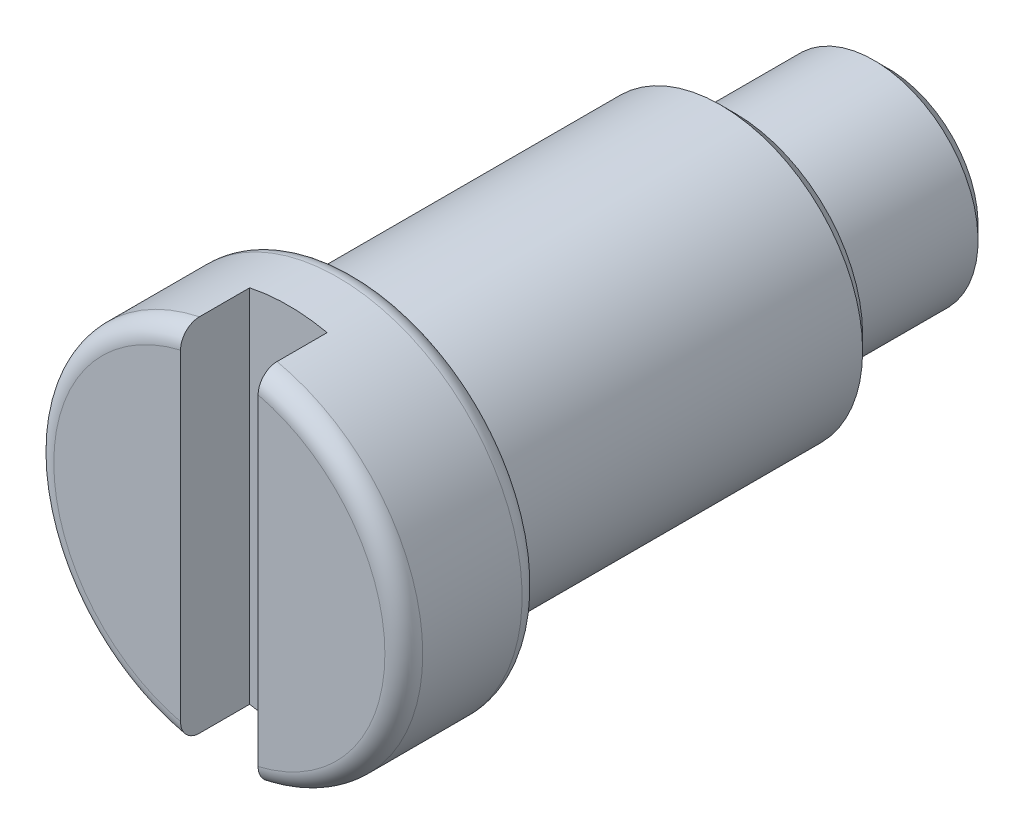
ISO-10303-21;
HEADER;
FILE_DESCRIPTION(('STEP AP214'),'2;1');
FILE_NAME('part.step','',(''),(''),'','','');
FILE_SCHEMA(('AUTOMOTIVE_DESIGN { 1 0 10303 214 1 1 1 1 }'));
ENDSEC;
DATA;
#1=APPLICATION_CONTEXT('core data for automotive mechanical design processes');
#2=APPLICATION_PROTOCOL_DEFINITION('international standard','automotive_design',2000,#1);
#3=PRODUCT_CONTEXT('',#1,'mechanical');
#4=PRODUCT('Part','Part','',(#3));
#5=PRODUCT_RELATED_PRODUCT_CATEGORY('part','',(#4));
#6=PRODUCT_DEFINITION_FORMATION('','',#4);
#7=PRODUCT_DEFINITION_CONTEXT('part definition',#1,'design');
#8=PRODUCT_DEFINITION('design','',#6,#7);
#9=PRODUCT_DEFINITION_SHAPE('','',#8);
#10=(LENGTH_UNIT() NAMED_UNIT(*) SI_UNIT(.MILLI.,.METRE.));
#11=(NAMED_UNIT(*) PLANE_ANGLE_UNIT() SI_UNIT($,.RADIAN.));
#12=(NAMED_UNIT(*) SI_UNIT($,.STERADIAN.) SOLID_ANGLE_UNIT());
#13=UNCERTAINTY_MEASURE_WITH_UNIT(LENGTH_MEASURE(1.E-05),#10,'distance_accuracy_value','');
#14=(GEOMETRIC_REPRESENTATION_CONTEXT(3) GLOBAL_UNCERTAINTY_ASSIGNED_CONTEXT((#13)) GLOBAL_UNIT_ASSIGNED_CONTEXT((#10,
#11,#12)) REPRESENTATION_CONTEXT('',''));
#15=CARTESIAN_POINT('',(0.,0.,0.));
#16=DIRECTION('',(0.,0.,1.));
#17=DIRECTION('',(1.,0.,0.));
#18=AXIS2_PLACEMENT_3D('',#15,#16,#17);
#19=CARTESIAN_POINT('',(-0.41,-8.96687794051,-0.73));
#20=DIRECTION('',(0.,0.,1.));
#21=DIRECTION('',(1.,0.,0.));
#22=AXIS2_PLACEMENT_3D('',#19,#20,#21);
#23=PLANE('',#22);
#24=CARTESIAN_POINT('',(0.,0.,-0.73));
#25=DIRECTION('',(0.,0.,-1.));
#26=DIRECTION('',(-1.,0.,0.));
#27=AXIS2_PLACEMENT_3D('',#24,#25,#26);
#28=CIRCLE('',#27,1.95);
#29=CARTESIAN_POINT('',(0.41,1.9064102391754,-0.73));
#30=VERTEX_POINT('',#29);
#31=CARTESIAN_POINT('',(-0.41,1.9064102391669,-0.73));
#32=VERTEX_POINT('',#31);
#33=EDGE_CURVE('E80',#30,#32,#28,.F.);
#34=ORIENTED_EDGE('',*,*,#33,.T.);
#35=DIRECTION('',(0.,1.,0.));
#36=VECTOR('',#35,1.);
#37=CARTESIAN_POINT('',(-0.41,-8.96687794051,-0.73));
#38=LINE('',#37,#36);
#39=CARTESIAN_POINT('',(-0.41,-1.9064102391669,-0.73));
#40=VERTEX_POINT('',#39);
#41=EDGE_CURVE('E82',#40,#32,#38,.T.);
#42=ORIENTED_EDGE('',*,*,#41,.F.);
#43=CARTESIAN_POINT('',(0.,0.,-0.73));
#44=DIRECTION('',(0.,0.,-1.));
#45=DIRECTION('',(-1.,0.,0.));
#46=AXIS2_PLACEMENT_3D('',#43,#44,#45);
#47=CIRCLE('',#46,1.95);
#48=CARTESIAN_POINT('',(0.41,-1.9064102391669,-0.73));
#49=VERTEX_POINT('',#48);
#50=EDGE_CURVE('E20',#40,#49,#47,.F.);
#51=ORIENTED_EDGE('',*,*,#50,.T.);
#52=DIRECTION('',(0.,1.,0.));
#53=VECTOR('',#52,1.);
#54=CARTESIAN_POINT('',(0.41,-8.96687794051,-0.73));
#55=LINE('',#54,#53);
#56=EDGE_CURVE('E89',#30,#49,#55,.F.);
#57=ORIENTED_EDGE('',*,*,#56,.F.);
#58=EDGE_LOOP('',(#34,#42,#51,#57));
#59=FACE_BOUND('',#58,.T.);
#60=ADVANCED_FACE('F17',(#59),#23,.T.);
#61=CARTESIAN_POINT('',(0.41,-8.96687794051,-0.73));
#62=DIRECTION('',(-1.,0.,0.));
#63=DIRECTION('',(0.,0.,1.));
#64=AXIS2_PLACEMENT_3D('',#61,#62,#63);
#65=PLANE('',#64);
#66=DIRECTION('',(0.,0.,1.));
#67=VECTOR('',#66,1.);
#68=CARTESIAN_POINT('',(0.41,1.906410239184,-0.73));
#69=LINE('',#68,#67);
#70=CARTESIAN_POINT('',(0.41,1.9064102391754,-0.199999999997));
#71=VERTEX_POINT('',#70);
#72=EDGE_CURVE('E91',#71,#30,#69,.F.);
#73=ORIENTED_EDGE('',*,*,#72,.T.);
#74=ORIENTED_EDGE('',*,*,#56,.T.);
#75=DIRECTION('',(0.,0.,1.));
#76=VECTOR('',#75,1.);
#77=CARTESIAN_POINT('',(0.41,-1.906410239167,-0.73));
#78=LINE('',#77,#76);
#79=CARTESIAN_POINT('',(0.409999999999999,-1.9064102391669,-0.1999999999982));
#80=VERTEX_POINT('',#79);
#81=EDGE_CURVE('E76',#49,#80,#78,.T.);
#82=ORIENTED_EDGE('',*,*,#81,.T.);
#83=CARTESIAN_POINT('',(0.409999999999999,-1.9064102391668,-0.1999999999994));
#84=CARTESIAN_POINT('',(0.410000000000001,-1.90642073201662,-0.188935909425886));
#85=CARTESIAN_POINT('',(0.41,-1.90547181301739,-0.17787601446626));
#86=CARTESIAN_POINT('',(0.409999999999999,-1.90173416208713,-0.156086634893258));
#87=CARTESIAN_POINT('',(0.409999999999998,-1.89894796519605,-0.14535671630541));
#88=CARTESIAN_POINT('',(0.409999999999998,-1.89161334067293,-0.12451421506964));
#89=CARTESIAN_POINT('',(0.409999999999999,-1.88706441660261,-0.11440180726134));
#90=CARTESIAN_POINT('',(0.41,-1.87634918228616,-0.095075278442462));
#91=CARTESIAN_POINT('',(0.409999999999999,-1.87018289207332,-0.0858611463074552));
#92=CARTESIAN_POINT('',(0.409999999999999,-1.85635504906559,-0.0684963080743695));
#93=CARTESIAN_POINT('',(0.41,-1.84868044255964,-0.0603560043149509));
#94=CARTESIAN_POINT('',(0.409999999999999,-1.83209823806731,-0.0454459635773487));
#95=CARTESIAN_POINT('',(0.409999999999998,-1.82319043083293,-0.0386764596758893));
#96=CARTESIAN_POINT('',(0.409999999999998,-1.80419297936883,-0.0265439694319283));
#97=CARTESIAN_POINT('',(0.409999999999999,-1.79408202654268,-0.0212143879963644));
#98=CARTESIAN_POINT('',(0.41,-1.77312406597645,-0.012284540769646));
#99=CARTESIAN_POINT('',(0.409999999999999,-1.76227719565737,-0.00868395312492724));
#100=CARTESIAN_POINT('',(0.409999999999999,-1.74304683526872,-0.00399599964380329));
#101=CARTESIAN_POINT('',(0.409999999999999,-1.73476082665802,-0.00249765790653519));
#102=CARTESIAN_POINT('',(0.41,-1.71808183905436,-0.000499679376716791));
#103=CARTESIAN_POINT('',(0.410000000000001,-1.70968903928075,1.45300888987605E-06));
#104=CARTESIAN_POINT('',(0.410000000000001,-1.70129362545099,0.));
#105=B_SPLINE_CURVE_WITH_KNOTS('',3,(#83,#84,#85,#86,#87,#88,#89,#90,#91,#92,#93,#94,#95,#96,
#97,#98,#99,#100,#101,#102,#103,#104),.UNSPECIFIED.,.F.,.F.,(4,2,2,2,2,2,2,2,2,2,4),(0.,
0.0331453845891454,0.0662451312529841,0.0993542066082952,0.132462871881988,0.165871807589145,
0.199286419047546,0.233420144854118,0.267547514175047,0.292751405910464,0.317917468817511),.UNSPECIFIED.);
#106=CARTESIAN_POINT('',(0.41,-1.701293625451,0.));
#107=VERTEX_POINT('',#106);
#108=EDGE_CURVE('E99',#80,#107,#105,.T.);
#109=ORIENTED_EDGE('',*,*,#108,.T.);
#110=DIRECTION('',(0.,1.,0.));
#111=VECTOR('',#110,1.);
#112=CARTESIAN_POINT('',(0.41,0.,0.));
#113=LINE('',#112,#111);
#114=CARTESIAN_POINT('',(0.41,1.701293625451,0.));
#115=VERTEX_POINT('',#114);
#116=EDGE_CURVE('E119',#107,#115,#113,.T.);
#117=ORIENTED_EDGE('',*,*,#116,.T.);
#118=CARTESIAN_POINT('',(0.409999999999999,1.701293625451,0.));
#119=CARTESIAN_POINT('',(0.410000000002229,1.71306590904861,8.78214871465354E-06));
#120=CARTESIAN_POINT('',(0.410000000001304,1.7248381977497,-0.000981901612816971));
#121=CARTESIAN_POINT('',(0.409999999998695,1.74805561338932,-0.00490756838201299));
#122=CARTESIAN_POINT('',(0.409999999997009,1.75950069623836,-0.00784281213418027));
#123=CARTESIAN_POINT('',(0.409999999998427,1.78174299074401,-0.0156063587050561));
#124=CARTESIAN_POINT('',(0.410000000001535,1.79253962254991,-0.0204363275759226));
#125=CARTESIAN_POINT('',(0.409999999998465,1.81314685306385,-0.0318657093925813));
#126=CARTESIAN_POINT('',(0.409999999992293,1.82295790720166,-0.0384642998495639));
#127=CARTESIAN_POINT('',(0.409999999993566,1.84115406576136,-0.0531454088814542));
#128=CARTESIAN_POINT('',(0.410000000000806,1.84955854059986,-0.0612039028652662));
#129=CARTESIAN_POINT('',(0.409999999999194,1.86485290917502,-0.0786481254288913));
#130=CARTESIAN_POINT('',(0.409999999990345,1.87174315662201,-0.0880335432073086));
#131=CARTESIAN_POINT('',(0.409999999989569,1.88363996534004,-0.107622254778722));
#132=CARTESIAN_POINT('',(0.409999999997243,1.88868763260167,-0.117800622631082));
#133=CARTESIAN_POINT('',(0.410000000002754,1.89695967352409,-0.138868589182004));
#134=CARTESIAN_POINT('',(0.410000000000601,1.90018573741462,-0.149757518062343));
#135=CARTESIAN_POINT('',(0.40999999999965,1.90376613264431,-0.167279422370648));
#136=CARTESIAN_POINT('',(0.409999999999825,1.90475718075972,-0.173788735975535));
#137=CARTESIAN_POINT('',(0.410000000000174,1.90607898727918,-0.186864323551235));
#138=CARTESIAN_POINT('',(0.410000000000346,1.90641071913279,-0.193430499149179));
#139=CARTESIAN_POINT('',(0.409999999999992,1.9064102391668,-0.199999999998196));
#140=B_SPLINE_CURVE_WITH_KNOTS('',3,(#118,#119,#120,#121,#122,#123,#124,#125,#126,#127,#128,
#129,#130,#131,#132,#133,#134,#135,#136,#137,#138,#139),.UNSPECIFIED.,.F.,.F.,(4,2,2,2,2,2,2,2,
2,2,4),(0.,0.0352756157378741,0.0705559625126531,0.105867401464157,0.141162447410486,
0.175922174914147,0.210673774197639,0.244594325750203,0.278483351153767,0.298206112665351,
0.317899732747287),.UNSPECIFIED.);
#141=EDGE_CURVE('E98',#115,#71,#140,.T.);
#142=ORIENTED_EDGE('',*,*,#141,.T.);
#143=EDGE_LOOP('',(#73,#74,#82,#109,#117,#142));
#144=FACE_BOUND('',#143,.T.);
#145=ADVANCED_FACE('F354',(#144),#65,.T.);
#146=CARTESIAN_POINT('',(-0.41,-8.96687794051,0.));
#147=DIRECTION('',(1.,0.,0.));
#148=DIRECTION('',(0.,0.,-1.));
#149=AXIS2_PLACEMENT_3D('',#146,#147,#148);
#150=PLANE('',#149);
#151=DIRECTION('',(0.,1.,0.));
#152=VECTOR('',#151,1.);
#153=CARTESIAN_POINT('',(-0.41,0.,0.));
#154=LINE('',#153,#152);
#155=CARTESIAN_POINT('',(-0.41,1.701293625451,0.));
#156=VERTEX_POINT('',#155);
#157=CARTESIAN_POINT('',(-0.41,-1.701293625451,0.));
#158=VERTEX_POINT('',#157);
#159=EDGE_CURVE('E117',#156,#158,#154,.F.);
#160=ORIENTED_EDGE('',*,*,#159,.T.);
#161=CARTESIAN_POINT('',(-0.41,-1.701293625451,0.));
#162=CARTESIAN_POINT('',(-0.41000000000223,-1.71306590904861,8.78214871464386E-06));
#163=CARTESIAN_POINT('',(-0.410000000001305,-1.7248381977497,-0.000981901612817001));
#164=CARTESIAN_POINT('',(-0.409999999998695,-1.74805561338932,-0.00490756838201304));
#165=CARTESIAN_POINT('',(-0.409999999997009,-1.75950069623836,-0.00784281213418028));
#166=CARTESIAN_POINT('',(-0.409999999998427,-1.78174299074401,-0.015606358705056));
#167=CARTESIAN_POINT('',(-0.410000000001535,-1.79253962254991,-0.0204363275759224));
#168=CARTESIAN_POINT('',(-0.409999999998466,-1.81314685306385,-0.0318657093925812));
#169=CARTESIAN_POINT('',(-0.409999999992294,-1.82295790720166,-0.038464299849564));
#170=CARTESIAN_POINT('',(-0.409999999993567,-1.84115406576136,-0.0531454088814543));
#171=CARTESIAN_POINT('',(-0.410000000000806,-1.84955854059986,-0.0612039028652663));
#172=CARTESIAN_POINT('',(-0.409999999999194,-1.86485290917502,-0.0786481254288913));
#173=CARTESIAN_POINT('',(-0.409999999990345,-1.87174315662201,-0.0880335432073086));
#174=CARTESIAN_POINT('',(-0.40999999998957,-1.88363996534004,-0.107622254778722));
#175=CARTESIAN_POINT('',(-0.409999999997244,-1.88868763260167,-0.117800622631081));
#176=CARTESIAN_POINT('',(-0.410000000002754,-1.89695967352409,-0.138868589182003));
#177=CARTESIAN_POINT('',(-0.410000000000599,-1.90018573741462,-0.149757518062343));
#178=CARTESIAN_POINT('',(-0.409999999999648,-1.90376613264437,-0.167279422370942));
#179=CARTESIAN_POINT('',(-0.409999999999825,-1.90475718075981,-0.173788735976129));
#180=CARTESIAN_POINT('',(-0.410000000000175,-1.90607898727927,-0.186864323552431));
#181=CARTESIAN_POINT('',(-0.410000000000348,-1.90641071913285,-0.193430499150679));
#182=CARTESIAN_POINT('',(-0.409999999999993,-1.9064102391668,-0.199999999999996));
#183=B_SPLINE_CURVE_WITH_KNOTS('',3,(#161,#162,#163,#164,#165,#166,#167,#168,#169,#170,#171,
#172,#173,#174,#175,#176,#177,#178,#179,#180,#181,#182),.UNSPECIFIED.,.F.,.F.,(4,2,2,2,2,2,2,2,
2,2,4),(0.,0.0352756157378745,0.0705559625126533,0.105867401464157,0.141162447410486,
0.175922174914147,0.210673774197639,0.244594325750202,0.278483351153768,0.29820611266625,
0.317899732749085),.UNSPECIFIED.);
#184=CARTESIAN_POINT('',(-0.41,-1.9064102391669,-0.2));
#185=VERTEX_POINT('',#184);
#186=EDGE_CURVE('E35',#158,#185,#183,.T.);
#187=ORIENTED_EDGE('',*,*,#186,.T.);
#188=DIRECTION('',(0.,0.,-1.));
#189=VECTOR('',#188,1.);
#190=CARTESIAN_POINT('',(-0.41,-1.906410239167,0.));
#191=LINE('',#190,#189);
#192=EDGE_CURVE('E73',#185,#40,#191,.T.);
#193=ORIENTED_EDGE('',*,*,#192,.T.);
#194=ORIENTED_EDGE('',*,*,#41,.T.);
#195=DIRECTION('',(0.,0.,-1.));
#196=VECTOR('',#195,1.);
#197=CARTESIAN_POINT('',(-0.41,1.906410239167,0.));
#198=LINE('',#197,#196);
#199=CARTESIAN_POINT('',(-0.41,1.9064102391669,-0.2));
#200=VERTEX_POINT('',#199);
#201=EDGE_CURVE('E86',#32,#200,#198,.F.);
#202=ORIENTED_EDGE('',*,*,#201,.T.);
#203=CARTESIAN_POINT('',(-0.41,1.9064102391668,-0.2));
#204=CARTESIAN_POINT('',(-0.41,1.90642073201665,-0.188935909426487));
#205=CARTESIAN_POINT('',(-0.41,1.90547181301746,-0.177876014466859));
#206=CARTESIAN_POINT('',(-0.41,1.90173416208727,-0.156086634893848));
#207=CARTESIAN_POINT('',(-0.41,1.89894796519622,-0.145356716305992));
#208=CARTESIAN_POINT('',(-0.41,1.89161334067317,-0.124514215070201));
#209=CARTESIAN_POINT('',(-0.41,1.88706441660288,-0.114401807261888));
#210=CARTESIAN_POINT('',(-0.41,1.87634918228649,-0.0950752784429788));
#211=CARTESIAN_POINT('',(-0.409999999999999,1.87018289207367,-0.085861146307954));
#212=CARTESIAN_POINT('',(-0.41,1.856355049066,-0.0684963080748281));
#213=CARTESIAN_POINT('',(-0.41,1.84868044256008,-0.0603560043153873));
#214=CARTESIAN_POINT('',(-0.41,1.83209823806779,-0.045445963577737));
#215=CARTESIAN_POINT('',(-0.41,1.82319043083343,-0.0386764596762518));
#216=CARTESIAN_POINT('',(-0.409999999999999,1.80419297936938,-0.0265439694322356));
#217=CARTESIAN_POINT('',(-0.41,1.79408202654325,-0.0212143879966421));
#218=CARTESIAN_POINT('',(-0.41,1.77312406597704,-0.012284540769862));
#219=CARTESIAN_POINT('',(-0.41,1.76227719565798,-0.00868395312511121));
#220=CARTESIAN_POINT('',(-0.41,1.74304683526924,-0.00399599964390427));
#221=CARTESIAN_POINT('',(-0.41,1.73476082665844,-0.00249765790659835));
#222=CARTESIAN_POINT('',(-0.41,1.71808183905457,-0.000499679376729377));
#223=CARTESIAN_POINT('',(-0.41,1.70968903928086,1.45300889005112E-06));
#224=CARTESIAN_POINT('',(-0.410000000000001,1.70129362545099,0.));
#225=B_SPLINE_CURVE_WITH_KNOTS('',3,(#203,#204,#205,#206,#207,#208,#209,#210,#211,#212,#213,
#214,#215,#216,#217,#218,#219,#220,#221,#222,#223,#224),.UNSPECIFIED.,.F.,.F.,(4,2,2,2,2,2,2,2,
2,2,4),(0.,0.0331453845891425,0.0662451312529782,0.0993542066082864,0.132462871881977,
0.165871807589129,0.199286419047523,0.233420144854088,0.26754751417501,0.292751405910745,
0.31791746881811),.UNSPECIFIED.);
#226=EDGE_CURVE('E120',#200,#156,#225,.T.);
#227=ORIENTED_EDGE('',*,*,#226,.T.);
#228=EDGE_LOOP('',(#160,#187,#193,#194,#202,#227));
#229=FACE_BOUND('',#228,.T.);
#230=ADVANCED_FACE('F88',(#229),#150,.T.);
#231=CARTESIAN_POINT('',(0.,0.,-7.07));
#232=DIRECTION('',(0.,0.,-1.));
#233=DIRECTION('',(-1.,0.,0.));
#234=AXIS2_PLACEMENT_3D('',#231,#232,#233);
#235=PLANE('',#234);
#236=CARTESIAN_POINT('',(0.,0.,-7.06999999994196));
#237=DIRECTION('',(0.,0.,1.));
#238=DIRECTION('',(0.,-1.,0.));
#239=AXIS2_PLACEMENT_3D('',#236,#237,#238);
#240=CIRCLE('',#239,0.950000000045748);
#241=CARTESIAN_POINT('',(0.,-0.950000000045747,-7.06999999994196));
#242=VERTEX_POINT('',#241);
#243=EDGE_CURVE('E113',#242,#242,#240,.T.);
#244=ORIENTED_EDGE('',*,*,#243,.F.);
#245=EDGE_LOOP('',(#244));
#246=FACE_BOUND('',#245,.T.);
#247=ADVANCED_FACE('F176',(#246),#235,.T.);
#248=CARTESIAN_POINT('',(0.,0.,0.));
#249=DIRECTION('',(0.,0.,-1.));
#250=DIRECTION('',(-1.,0.,0.));
#251=AXIS2_PLACEMENT_3D('',#248,#249,#250);
#252=PLANE('',#251);
#253=ORIENTED_EDGE('',*,*,#116,.F.);
#254=CARTESIAN_POINT('',(0.,0.,0.));
#255=DIRECTION('',(0.,0.,-1.));
#256=DIRECTION('',(0.234285714285706,0.972167785971967,0.));
#257=AXIS2_PLACEMENT_3D('',#254,#255,#256);
#258=CIRCLE('',#257,1.75000000000006);
#259=EDGE_CURVE('E116',#115,#107,#258,.T.);
#260=ORIENTED_EDGE('',*,*,#259,.F.);
#261=EDGE_LOOP('',(#253,#260));
#262=FACE_BOUND('',#261,.T.);
#263=ADVANCED_FACE('F173',(#262),#252,.F.);
#264=CARTESIAN_POINT('',(0.,0.,0.));
#265=DIRECTION('',(0.,0.,-1.));
#266=DIRECTION('',(-1.,0.,0.));
#267=AXIS2_PLACEMENT_3D('',#264,#265,#266);
#268=PLANE('',#267);
#269=CARTESIAN_POINT('',(0.,0.,0.));
#270=DIRECTION('',(0.,0.,-1.));
#271=DIRECTION('',(-0.234285714285706,-0.972167785971967,0.));
#272=AXIS2_PLACEMENT_3D('',#269,#270,#271);
#273=CIRCLE('',#272,1.75000000000006);
#274=EDGE_CURVE('E157',#158,#156,#273,.T.);
#275=ORIENTED_EDGE('',*,*,#274,.F.);
#276=ORIENTED_EDGE('',*,*,#159,.F.);
#277=EDGE_LOOP('',(#275,#276));
#278=FACE_BOUND('',#277,.T.);
#279=ADVANCED_FACE('F163',(#278),#268,.F.);
#280=CARTESIAN_POINT('',(0.,0.,-6.91999999997961));
#281=DIRECTION('',(0.,0.,1.));
#282=DIRECTION('',(0.,-1.,0.));
#283=AXIS2_PLACEMENT_3D('',#280,#281,#282);
#284=CONICAL_SURFACE('',#283,1.10000000000809,0.785398163397448);
#285=ORIENTED_EDGE('',*,*,#243,.T.);
#286=EDGE_LOOP('',(#285));
#287=FACE_BOUND('',#286,.T.);
#288=CARTESIAN_POINT('',(0.,0.,-6.92));
#289=DIRECTION('',(0.,0.,-1.));
#290=DIRECTION('',(-1.,0.,0.));
#291=AXIS2_PLACEMENT_3D('',#288,#289,#290);
#292=CIRCLE('',#291,1.1);
#293=CARTESIAN_POINT('',(-1.1,0.,-6.92));
#294=VERTEX_POINT('',#293);
#295=EDGE_CURVE('E112',#294,#294,#292,.F.);
#296=ORIENTED_EDGE('',*,*,#295,.F.);
#297=EDGE_LOOP('',(#296));
#298=FACE_BOUND('',#297,.T.);
#299=ADVANCED_FACE('F172',(#287,#298),#284,.T.);
#300=CARTESIAN_POINT('',(0.,0.,-0.2));
#301=DIRECTION('',(0.,0.,-1.));
#302=DIRECTION('',(-1.,0.,0.));
#303=AXIS2_PLACEMENT_3D('',#300,#301,#302);
#304=TOROIDAL_SURFACE('',#303,1.75,0.2);
#305=ORIENTED_EDGE('',*,*,#108,.F.);
#306=CARTESIAN_POINT('',(0.,0.,-0.199999999997));
#307=DIRECTION('',(0.,0.,-1.));
#308=DIRECTION('',(-1.,0.,0.));
#309=AXIS2_PLACEMENT_3D('',#306,#307,#308);
#310=CIRCLE('',#309,1.95);
#311=EDGE_CURVE('E110',#71,#80,#310,.T.);
#312=ORIENTED_EDGE('',*,*,#311,.F.);
#313=ORIENTED_EDGE('',*,*,#141,.F.);
#314=ORIENTED_EDGE('',*,*,#259,.T.);
#315=EDGE_LOOP('',(#305,#312,#313,#314));
#316=FACE_BOUND('',#315,.T.);
#317=ADVANCED_FACE('F139',(#316),#304,.T.);
#318=CARTESIAN_POINT('',(0.,0.,-0.2));
#319=DIRECTION('',(0.,0.,-1.));
#320=DIRECTION('',(-1.,0.,0.));
#321=AXIS2_PLACEMENT_3D('',#318,#319,#320);
#322=TOROIDAL_SURFACE('',#321,1.75,0.2);
#323=ORIENTED_EDGE('',*,*,#186,.F.);
#324=ORIENTED_EDGE('',*,*,#274,.T.);
#325=ORIENTED_EDGE('',*,*,#226,.F.);
#326=CARTESIAN_POINT('',(0.,0.,-0.2));
#327=DIRECTION('',(0.,0.,-1.));
#328=DIRECTION('',(-1.,0.,0.));
#329=AXIS2_PLACEMENT_3D('',#326,#327,#328);
#330=CIRCLE('',#329,1.95);
#331=EDGE_CURVE('E109',#185,#200,#330,.T.);
#332=ORIENTED_EDGE('',*,*,#331,.F.);
#333=EDGE_LOOP('',(#323,#324,#325,#332));
#334=FACE_BOUND('',#333,.T.);
#335=ADVANCED_FACE('F132',(#334),#322,.T.);
#336=CARTESIAN_POINT('',(0.,0.,-14.42646313088));
#337=DIRECTION('',(0.,0.,-1.));
#338=DIRECTION('',(-1.,0.,0.));
#339=AXIS2_PLACEMENT_3D('',#336,#337,#338);
#340=CYLINDRICAL_SURFACE('',#339,1.1);
#341=CARTESIAN_POINT('',(0.,0.,-5.45));
#342=DIRECTION('',(0.,0.,-1.));
#343=DIRECTION('',(-1.,0.,0.));
#344=AXIS2_PLACEMENT_3D('',#341,#342,#343);
#345=CIRCLE('',#344,1.1);
#346=CARTESIAN_POINT('',(-1.1,0.,-5.45));
#347=VERTEX_POINT('',#346);
#348=EDGE_CURVE('E106',#347,#347,#345,.T.);
#349=ORIENTED_EDGE('',*,*,#348,.T.);
#350=EDGE_LOOP('',(#349));
#351=FACE_BOUND('',#350,.T.);
#352=ORIENTED_EDGE('',*,*,#295,.T.);
#353=EDGE_LOOP('',(#352));
#354=FACE_BOUND('',#353,.T.);
#355=ADVANCED_FACE('F138',(#351,#354),#340,.T.);
#356=CARTESIAN_POINT('',(0.,0.,-1.45));
#357=DIRECTION('',(0.,0.,-1.));
#358=DIRECTION('',(-1.,0.,0.));
#359=AXIS2_PLACEMENT_3D('',#356,#357,#358);
#360=CYLINDRICAL_SURFACE('',#359,1.95);
#361=ORIENTED_EDGE('',*,*,#33,.F.);
#362=ORIENTED_EDGE('',*,*,#72,.F.);
#363=ORIENTED_EDGE('',*,*,#311,.T.);
#364=ORIENTED_EDGE('',*,*,#81,.F.);
#365=ORIENTED_EDGE('',*,*,#50,.F.);
#366=ORIENTED_EDGE('',*,*,#192,.F.);
#367=ORIENTED_EDGE('',*,*,#331,.T.);
#368=ORIENTED_EDGE('',*,*,#201,.F.);
#369=EDGE_LOOP('',(#361,#362,#363,#364,#365,#366,#367,#368));
#370=FACE_BOUND('',#369,.T.);
#371=CARTESIAN_POINT('',(0.,0.,-1.25));
#372=DIRECTION('',(0.,0.,-1.));
#373=DIRECTION('',(-1.,0.,0.));
#374=AXIS2_PLACEMENT_3D('',#371,#372,#373);
#375=CIRCLE('',#374,1.95);
#376=CARTESIAN_POINT('',(-1.95,0.,-1.25));
#377=VERTEX_POINT('',#376);
#378=EDGE_CURVE('E105',#377,#377,#375,.T.);
#379=ORIENTED_EDGE('',*,*,#378,.F.);
#380=EDGE_LOOP('',(#379));
#381=FACE_BOUND('',#380,.T.);
#382=ADVANCED_FACE('F69',(#370,#381),#360,.T.);
#383=CARTESIAN_POINT('',(0.,0.,-5.45));
#384=DIRECTION('',(0.,0.,1.));
#385=DIRECTION('',(1.,0.,0.));
#386=AXIS2_PLACEMENT_3D('',#383,#384,#385);
#387=PLANE('',#386);
#388=ORIENTED_EDGE('',*,*,#348,.F.);
#389=EDGE_LOOP('',(#388));
#390=FACE_BOUND('',#389,.T.);
#391=CARTESIAN_POINT('',(0.,0.,-5.44999999999618));
#392=DIRECTION('',(0.,0.,1.));
#393=DIRECTION('',(1.,0.,0.));
#394=AXIS2_PLACEMENT_3D('',#391,#392,#393);
#395=CIRCLE('',#394,1.35000000000218);
#396=CARTESIAN_POINT('',(1.35000000000218,0.,-5.44999999999618));
#397=VERTEX_POINT('',#396);
#398=EDGE_CURVE('E101',#397,#397,#395,.T.);
#399=ORIENTED_EDGE('',*,*,#398,.F.);
#400=EDGE_LOOP('',(#399));
#401=FACE_BOUND('',#400,.T.);
#402=ADVANCED_FACE('F229',(#390,#401),#387,.F.);
#403=CARTESIAN_POINT('',(0.,0.,-1.25));
#404=DIRECTION('',(0.,0.,-1.));
#405=DIRECTION('',(-1.,0.,0.));
#406=AXIS2_PLACEMENT_3D('',#403,#404,#405);
#407=TOROIDAL_SURFACE('',#406,1.75,0.2);
#408=CARTESIAN_POINT('',(0.,0.,-1.45));
#409=DIRECTION('',(0.,0.,1.));
#410=DIRECTION('',(-1.,0.,0.));
#411=AXIS2_PLACEMENT_3D('',#408,#409,#410);
#412=CIRCLE('',#411,1.75);
#413=CARTESIAN_POINT('',(-1.75,0.,-1.45));
#414=VERTEX_POINT('',#413);
#415=EDGE_CURVE('E104',#414,#414,#412,.F.);
#416=ORIENTED_EDGE('',*,*,#415,.F.);
#417=EDGE_LOOP('',(#416));
#418=FACE_BOUND('',#417,.T.);
#419=ORIENTED_EDGE('',*,*,#378,.T.);
#420=EDGE_LOOP('',(#419));
#421=FACE_BOUND('',#420,.T.);
#422=ADVANCED_FACE('F217',(#418,#421),#407,.T.);
#423=CARTESIAN_POINT('',(0.,0.,-5.30000000009068));
#424=DIRECTION('',(0.,0.,1.));
#425=DIRECTION('',(1.,0.,0.));
#426=AXIS2_PLACEMENT_3D('',#423,#424,#425);
#427=CONICAL_SURFACE('',#426,1.49999999990769,0.785398163397448);
#428=CARTESIAN_POINT('',(0.,0.,-5.3));
#429=DIRECTION('',(0.,0.,-1.));
#430=DIRECTION('',(-1.,0.,0.));
#431=AXIS2_PLACEMENT_3D('',#428,#429,#430);
#432=CIRCLE('',#431,1.5);
#433=CARTESIAN_POINT('',(-1.5,0.,-5.3));
#434=VERTEX_POINT('',#433);
#435=EDGE_CURVE('E26',#434,#434,#432,.F.);
#436=ORIENTED_EDGE('',*,*,#435,.F.);
#437=EDGE_LOOP('',(#436));
#438=FACE_BOUND('',#437,.T.);
#439=ORIENTED_EDGE('',*,*,#398,.T.);
#440=EDGE_LOOP('',(#439));
#441=FACE_BOUND('',#440,.T.);
#442=ADVANCED_FACE('F228',(#438,#441),#427,.T.);
#443=CARTESIAN_POINT('',(0.,0.,-1.45));
#444=DIRECTION('',(0.,0.,-1.));
#445=DIRECTION('',(-1.,0.,0.));
#446=AXIS2_PLACEMENT_3D('',#443,#444,#445);
#447=PLANE('',#446);
#448=CARTESIAN_POINT('',(0.,0.,-1.45));
#449=DIRECTION('',(0.,0.,-1.));
#450=DIRECTION('',(-1.,0.,0.));
#451=AXIS2_PLACEMENT_3D('',#448,#449,#450);
#452=CIRCLE('',#451,1.5);
#453=CARTESIAN_POINT('',(-1.5,0.,-1.45));
#454=VERTEX_POINT('',#453);
#455=EDGE_CURVE('E11',#454,#454,#452,.T.);
#456=ORIENTED_EDGE('',*,*,#455,.F.);
#457=EDGE_LOOP('',(#456));
#458=FACE_BOUND('',#457,.T.);
#459=ORIENTED_EDGE('',*,*,#415,.T.);
#460=EDGE_LOOP('',(#459));
#461=FACE_BOUND('',#460,.T.);
#462=ADVANCED_FACE('F250',(#458,#461),#447,.T.);
#463=CARTESIAN_POINT('',(0.,0.,-7.07));
#464=DIRECTION('',(0.,0.,-1.));
#465=DIRECTION('',(-1.,0.,0.));
#466=AXIS2_PLACEMENT_3D('',#463,#464,#465);
#467=CYLINDRICAL_SURFACE('',#466,1.5);
#468=ORIENTED_EDGE('',*,*,#455,.T.);
#469=EDGE_LOOP('',(#468));
#470=FACE_BOUND('',#469,.T.);
#471=ORIENTED_EDGE('',*,*,#435,.T.);
#472=EDGE_LOOP('',(#471));
#473=FACE_BOUND('',#472,.T.);
#474=ADVANCED_FACE('F248',(#470,#473),#467,.T.);
#475=CLOSED_SHELL('',(#60,#145,#230,#247,#263,#279,#299,#317,#335,#355,#382,#402,#422,#442,#462,#474));
#476=MANIFOLD_SOLID_BREP('B1',#475);
#477=ADVANCED_BREP_SHAPE_REPRESENTATION('',(#18,#476),#14);
#478=SHAPE_DEFINITION_REPRESENTATION(#9,#477);
ENDSEC;
END-ISO-10303-21;
